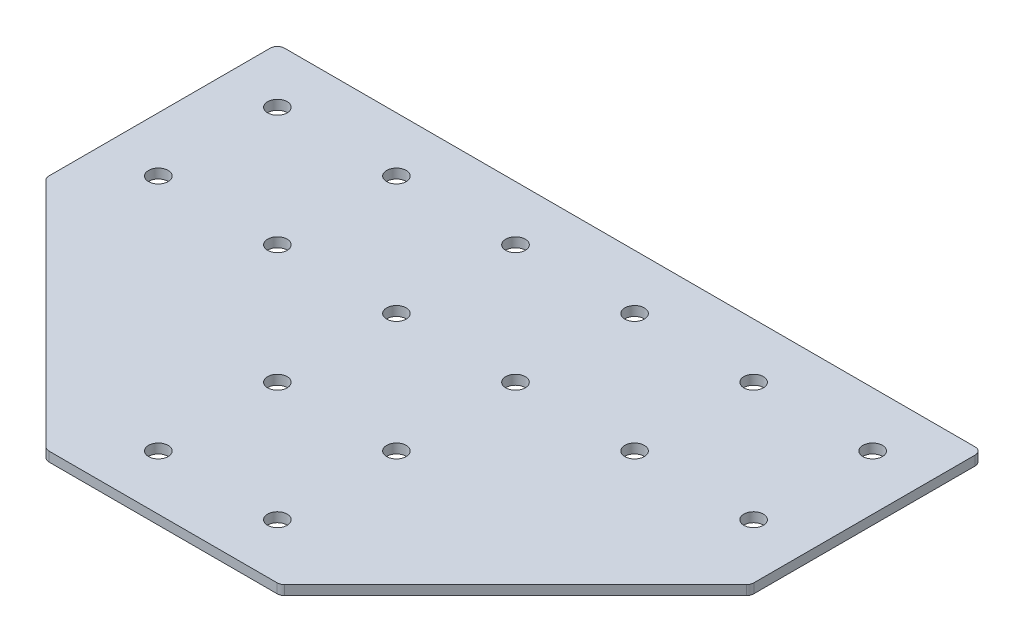
ISO-10303-21;
HEADER;
FILE_DESCRIPTION(('STEP AP214'),'2;1');
FILE_NAME('part.step','',(''),(''),'','','');
FILE_SCHEMA(('AUTOMOTIVE_DESIGN { 1 0 10303 214 1 1 1 1 }'));
ENDSEC;
DATA;
#1=APPLICATION_CONTEXT('core data for automotive mechanical design processes');
#2=APPLICATION_PROTOCOL_DEFINITION('international standard','automotive_design',2000,#1);
#3=PRODUCT_CONTEXT('',#1,'mechanical');
#4=PRODUCT('Part','Part','',(#3));
#5=PRODUCT_RELATED_PRODUCT_CATEGORY('part','',(#4));
#6=PRODUCT_DEFINITION_FORMATION('','',#4);
#7=PRODUCT_DEFINITION_CONTEXT('part definition',#1,'design');
#8=PRODUCT_DEFINITION('design','',#6,#7);
#9=PRODUCT_DEFINITION_SHAPE('','',#8);
#10=(LENGTH_UNIT() NAMED_UNIT(*) SI_UNIT(.MILLI.,.METRE.));
#11=(NAMED_UNIT(*) PLANE_ANGLE_UNIT() SI_UNIT($,.RADIAN.));
#12=(NAMED_UNIT(*) SI_UNIT($,.STERADIAN.) SOLID_ANGLE_UNIT());
#13=UNCERTAINTY_MEASURE_WITH_UNIT(LENGTH_MEASURE(1.E-05),#10,'distance_accuracy_value','');
#14=(GEOMETRIC_REPRESENTATION_CONTEXT(3) GLOBAL_UNCERTAINTY_ASSIGNED_CONTEXT((#13)) GLOBAL_UNIT_ASSIGNED_CONTEXT((#10,
#11,#12)) REPRESENTATION_CONTEXT('',''));
#15=CARTESIAN_POINT('',(0.,0.,0.));
#16=DIRECTION('',(0.,0.,1.));
#17=DIRECTION('',(1.,0.,0.));
#18=AXIS2_PLACEMENT_3D('',#15,#16,#17);
#19=CARTESIAN_POINT('',(-1.04930424271288,0.274709326684388,-51.2250354101297));
#20=DIRECTION('',(0.,-1.,0.));
#21=DIRECTION('',(0.,0.,-1.));
#22=AXIS2_PLACEMENT_3D('',#19,#20,#21);
#23=PLANE('',#22);
#24=DIRECTION('',(1.,0.,0.));
#25=VECTOR('',#24,1.);
#26=CARTESIAN_POINT('',(-49.049304242713,0.274709326684388,96.7749645898703));
#27=LINE('',#26,#25);
#28=CARTESIAN_POINT('',(-48.9782364308475,0.274709326684388,96.7749645898703));
#29=VERTEX_POINT('',#28);
#30=CARTESIAN_POINT('',(46.8796279454218,0.274709326684388,96.7749645898703));
#31=VERTEX_POINT('',#30);
#32=EDGE_CURVE('E218',#29,#31,#27,.T.);
#33=ORIENTED_EDGE('',*,*,#32,.F.);
#34=CARTESIAN_POINT('',(-48.9782364308475,0.274709326684388,93.7749645898703));
#35=DIRECTION('',(0.,1.,0.));
#36=DIRECTION('',(0.,0.,-1.));
#37=AXIS2_PLACEMENT_3D('',#34,#35,#36);
#38=CIRCLE('',#37,3.);
#39=CARTESIAN_POINT('',(-51.0995567744072,0.274709326684388,95.8962849334299));
#40=VERTEX_POINT('',#39);
#41=EDGE_CURVE('E154',#40,#29,#38,.T.);
#42=ORIENTED_EDGE('',*,*,#41,.F.);
#43=DIRECTION('',(-0.707106781186547,0.,-0.707106781186548));
#44=VECTOR('',#43,1.);
#45=CARTESIAN_POINT('',(-50.2208771179668,0.274709326684388,96.7749645898703));
#46=LINE('',#45,#44);
#47=CARTESIAN_POINT('',(-148.170624586272,0.274709326684388,-1.17478287843539));
#48=VERTEX_POINT('',#47);
#49=EDGE_CURVE('E141',#40,#48,#46,.T.);
#50=ORIENTED_EDGE('',*,*,#49,.T.);
#51=CARTESIAN_POINT('',(-146.049304242713,0.274709326684388,-3.29610322199503));
#52=DIRECTION('',(0.,1.,0.));
#53=DIRECTION('',(0.,0.,-1.));
#54=AXIS2_PLACEMENT_3D('',#51,#52,#53);
#55=CIRCLE('',#54,3.);
#56=CARTESIAN_POINT('',(-149.049304242713,0.274709326684388,-3.29610322199502));
#57=VERTEX_POINT('',#56);
#58=EDGE_CURVE('E152',#57,#48,#55,.T.);
#59=ORIENTED_EDGE('',*,*,#58,.F.);
#60=DIRECTION('',(0.,0.,-1.));
#61=VECTOR('',#60,1.);
#62=CARTESIAN_POINT('',(-149.049304242713,0.274709326684388,-2.05346253487575));
#63=LINE('',#62,#61);
#64=CARTESIAN_POINT('',(-149.049304242713,0.274709326684388,-96.2250354101297));
#65=VERTEX_POINT('',#64);
#66=EDGE_CURVE('E124',#57,#65,#63,.T.);
#67=ORIENTED_EDGE('',*,*,#66,.T.);
#68=CARTESIAN_POINT('',(-146.049304242713,0.274709326684388,-96.2250354101297));
#69=DIRECTION('',(0.,1.,0.));
#70=DIRECTION('',(0.,0.,-1.));
#71=AXIS2_PLACEMENT_3D('',#68,#69,#70);
#72=CIRCLE('',#71,3.);
#73=CARTESIAN_POINT('',(-146.049304242713,0.274709326684388,-99.2250354101297));
#74=VERTEX_POINT('',#73);
#75=EDGE_CURVE('E149',#74,#65,#72,.T.);
#76=ORIENTED_EDGE('',*,*,#75,.F.);
#77=DIRECTION('',(-1.,0.,0.));
#78=VECTOR('',#77,1.);
#79=CARTESIAN_POINT('',(146.950695757287,0.274709326684388,-99.2250354101297));
#80=LINE('',#79,#78);
#81=CARTESIAN_POINT('',(143.950695757287,0.274709326684388,-99.2250354101297));
#82=VERTEX_POINT('',#81);
#83=EDGE_CURVE('E215',#82,#74,#80,.T.);
#84=ORIENTED_EDGE('',*,*,#83,.F.);
#85=CARTESIAN_POINT('',(143.950695757287,0.274709326684388,-96.2250354101297));
#86=DIRECTION('',(0.,-1.,0.));
#87=DIRECTION('',(0.,0.,-1.));
#88=AXIS2_PLACEMENT_3D('',#85,#86,#87);
#89=CIRCLE('',#88,3.);
#90=CARTESIAN_POINT('',(146.950695757287,0.274709326684388,-96.2250354101297));
#91=VERTEX_POINT('',#90);
#92=EDGE_CURVE('E239',#82,#91,#89,.T.);
#93=ORIENTED_EDGE('',*,*,#92,.T.);
#94=DIRECTION('',(0.,0.,-1.));
#95=VECTOR('',#94,1.);
#96=CARTESIAN_POINT('',(146.950695757287,0.274709326684388,-2.05346253487579));
#97=LINE('',#96,#95);
#98=CARTESIAN_POINT('',(146.950695757287,0.274709326684388,-3.29610322199506));
#99=VERTEX_POINT('',#98);
#100=EDGE_CURVE('E212',#99,#91,#97,.T.);
#101=ORIENTED_EDGE('',*,*,#100,.F.);
#102=CARTESIAN_POINT('',(143.950695757287,0.274709326684388,-3.29610322199506));
#103=DIRECTION('',(0.,-1.,0.));
#104=DIRECTION('',(0.,0.,-1.));
#105=AXIS2_PLACEMENT_3D('',#102,#103,#104);
#106=CIRCLE('',#105,3.);
#107=CARTESIAN_POINT('',(146.072016100847,0.274709326684388,-1.17478287843542));
#108=VERTEX_POINT('',#107);
#109=EDGE_CURVE('E31',#99,#108,#106,.T.);
#110=ORIENTED_EDGE('',*,*,#109,.T.);
#111=DIRECTION('',(0.707106781186547,0.,-0.707106781186548));
#112=VECTOR('',#111,1.);
#113=CARTESIAN_POINT('',(48.1222686325411,0.274709326684388,96.7749645898703));
#114=LINE('',#113,#112);
#115=CARTESIAN_POINT('',(49.0009482889814,0.274709326684388,95.8962849334299));
#116=VERTEX_POINT('',#115);
#117=EDGE_CURVE('E220',#116,#108,#114,.T.);
#118=ORIENTED_EDGE('',*,*,#117,.F.);
#119=CARTESIAN_POINT('',(46.8796279454218,0.274709326684388,93.7749645898703));
#120=DIRECTION('',(0.,-1.,0.));
#121=DIRECTION('',(0.,0.,-1.));
#122=AXIS2_PLACEMENT_3D('',#119,#120,#121);
#123=CIRCLE('',#122,3.);
#124=EDGE_CURVE('E242',#116,#31,#123,.T.);
#125=ORIENTED_EDGE('',*,*,#124,.T.);
#126=EDGE_LOOP('',(#33,#42,#50,#59,#67,#76,#84,#93,#101,#110,#118,#125));
#127=FACE_BOUND('',#126,.T.);
#128=CARTESIAN_POINT('',(123.950695757287,0.274709326684388,-26.2250354101297));
#129=DIRECTION('',(0.,1.,0.));
#130=DIRECTION('',(0.,0.,1.));
#131=AXIS2_PLACEMENT_3D('',#128,#129,#130);
#132=CIRCLE('',#131,4.1);
#133=CARTESIAN_POINT('',(123.950695757287,0.274709326684388,-22.1250354101297));
#134=VERTEX_POINT('',#133);
#135=EDGE_CURVE('E164',#134,#134,#132,.T.);
#136=ORIENTED_EDGE('',*,*,#135,.T.);
#137=EDGE_LOOP('',(#136));
#138=FACE_BOUND('',#137,.T.);
#139=CARTESIAN_POINT('',(73.9506957572871,0.274709326684388,-26.2250354101297));
#140=DIRECTION('',(0.,1.,0.));
#141=DIRECTION('',(0.,0.,1.));
#142=AXIS2_PLACEMENT_3D('',#139,#140,#141);
#143=CIRCLE('',#142,4.09999999999999);
#144=CARTESIAN_POINT('',(73.9506957572871,0.274709326684388,-22.1250354101297));
#145=VERTEX_POINT('',#144);
#146=EDGE_CURVE('E170',#145,#145,#143,.T.);
#147=ORIENTED_EDGE('',*,*,#146,.T.);
#148=EDGE_LOOP('',(#147));
#149=FACE_BOUND('',#148,.T.);
#150=CARTESIAN_POINT('',(23.9506957572871,0.274709326684388,73.7749645898703));
#151=DIRECTION('',(0.,1.,0.));
#152=DIRECTION('',(0.,0.,1.));
#153=AXIS2_PLACEMENT_3D('',#150,#151,#152);
#154=CIRCLE('',#153,4.10000000000001);
#155=CARTESIAN_POINT('',(23.9506957572871,0.274709326684388,77.8749645898703));
#156=VERTEX_POINT('',#155);
#157=EDGE_CURVE('E176',#156,#156,#154,.T.);
#158=ORIENTED_EDGE('',*,*,#157,.T.);
#159=EDGE_LOOP('',(#158));
#160=FACE_BOUND('',#159,.T.);
#161=CARTESIAN_POINT('',(23.9506957572871,0.274709326684388,23.7749645898703));
#162=DIRECTION('',(0.,1.,0.));
#163=DIRECTION('',(0.,0.,1.));
#164=AXIS2_PLACEMENT_3D('',#161,#162,#163);
#165=CIRCLE('',#164,4.10000000000001);
#166=CARTESIAN_POINT('',(23.9506957572871,0.274709326684388,27.8749645898703));
#167=VERTEX_POINT('',#166);
#168=EDGE_CURVE('E182',#167,#167,#165,.T.);
#169=ORIENTED_EDGE('',*,*,#168,.T.);
#170=EDGE_LOOP('',(#169));
#171=FACE_BOUND('',#170,.T.);
#172=CARTESIAN_POINT('',(23.9506957572871,0.274709326684388,-26.2250354101297));
#173=DIRECTION('',(0.,1.,0.));
#174=DIRECTION('',(0.,0.,1.));
#175=AXIS2_PLACEMENT_3D('',#172,#173,#174);
#176=CIRCLE('',#175,4.1);
#177=CARTESIAN_POINT('',(23.9506957572871,0.274709326684388,-22.1250354101297));
#178=VERTEX_POINT('',#177);
#179=EDGE_CURVE('E188',#178,#178,#176,.T.);
#180=ORIENTED_EDGE('',*,*,#179,.T.);
#181=EDGE_LOOP('',(#180));
#182=FACE_BOUND('',#181,.T.);
#183=CARTESIAN_POINT('',(123.950695757287,0.274709326684388,-76.2250354101297));
#184=DIRECTION('',(0.,1.,0.));
#185=DIRECTION('',(0.,0.,1.));
#186=AXIS2_PLACEMENT_3D('',#183,#184,#185);
#187=CIRCLE('',#186,4.09999999999999);
#188=CARTESIAN_POINT('',(123.950695757287,0.274709326684388,-72.1250354101297));
#189=VERTEX_POINT('',#188);
#190=EDGE_CURVE('E194',#189,#189,#187,.T.);
#191=ORIENTED_EDGE('',*,*,#190,.T.);
#192=EDGE_LOOP('',(#191));
#193=FACE_BOUND('',#192,.T.);
#194=CARTESIAN_POINT('',(73.9506957572871,0.274709326684388,-76.2250354101297));
#195=DIRECTION('',(0.,1.,0.));
#196=DIRECTION('',(0.,0.,1.));
#197=AXIS2_PLACEMENT_3D('',#194,#195,#196);
#198=CIRCLE('',#197,4.09999999999999);
#199=CARTESIAN_POINT('',(73.9506957572871,0.274709326684388,-72.1250354101297));
#200=VERTEX_POINT('',#199);
#201=EDGE_CURVE('E200',#200,#200,#198,.T.);
#202=ORIENTED_EDGE('',*,*,#201,.T.);
#203=EDGE_LOOP('',(#202));
#204=FACE_BOUND('',#203,.T.);
#205=CARTESIAN_POINT('',(23.9506957572871,0.274709326684388,-76.2250354101297));
#206=DIRECTION('',(0.,1.,0.));
#207=DIRECTION('',(0.,0.,1.));
#208=AXIS2_PLACEMENT_3D('',#205,#206,#207);
#209=CIRCLE('',#208,4.1);
#210=CARTESIAN_POINT('',(23.9506957572871,0.274709326684388,-72.1250354101297));
#211=VERTEX_POINT('',#210);
#212=EDGE_CURVE('E206',#211,#211,#209,.T.);
#213=ORIENTED_EDGE('',*,*,#212,.T.);
#214=EDGE_LOOP('',(#213));
#215=FACE_BOUND('',#214,.T.);
#216=CARTESIAN_POINT('',(-126.049304242713,0.274709326684388,-26.2250354101296));
#217=DIRECTION('',(0.,-1.,0.));
#218=DIRECTION('',(0.,0.,1.));
#219=AXIS2_PLACEMENT_3D('',#216,#217,#218);
#220=CIRCLE('',#219,4.1);
#221=CARTESIAN_POINT('',(-126.049304242713,0.274709326684388,-22.1250354101296));
#222=VERTEX_POINT('',#221);
#223=EDGE_CURVE('E318',#222,#222,#220,.T.);
#224=ORIENTED_EDGE('',*,*,#223,.F.);
#225=EDGE_LOOP('',(#224));
#226=FACE_BOUND('',#225,.T.);
#227=CARTESIAN_POINT('',(-76.0493042427129,0.274709326684388,-26.2250354101297));
#228=DIRECTION('',(0.,-1.,0.));
#229=DIRECTION('',(0.,0.,1.));
#230=AXIS2_PLACEMENT_3D('',#227,#228,#229);
#231=CIRCLE('',#230,4.09999999999999);
#232=CARTESIAN_POINT('',(-76.0493042427129,0.274709326684388,-22.1250354101297));
#233=VERTEX_POINT('',#232);
#234=EDGE_CURVE('E312',#233,#233,#231,.T.);
#235=ORIENTED_EDGE('',*,*,#234,.F.);
#236=EDGE_LOOP('',(#235));
#237=FACE_BOUND('',#236,.T.);
#238=CARTESIAN_POINT('',(-26.0493042427128,0.274709326684388,73.7749645898703));
#239=DIRECTION('',(0.,-1.,0.));
#240=DIRECTION('',(0.,0.,1.));
#241=AXIS2_PLACEMENT_3D('',#238,#239,#240);
#242=CIRCLE('',#241,4.10000000000001);
#243=CARTESIAN_POINT('',(-26.0493042427128,0.274709326684388,77.8749645898703));
#244=VERTEX_POINT('',#243);
#245=EDGE_CURVE('E306',#244,#244,#242,.T.);
#246=ORIENTED_EDGE('',*,*,#245,.F.);
#247=EDGE_LOOP('',(#246));
#248=FACE_BOUND('',#247,.T.);
#249=CARTESIAN_POINT('',(-26.0493042427129,0.274709326684388,23.7749645898703));
#250=DIRECTION('',(0.,-1.,0.));
#251=DIRECTION('',(0.,0.,1.));
#252=AXIS2_PLACEMENT_3D('',#249,#250,#251);
#253=CIRCLE('',#252,4.10000000000001);
#254=CARTESIAN_POINT('',(-26.0493042427129,0.274709326684388,27.8749645898703));
#255=VERTEX_POINT('',#254);
#256=EDGE_CURVE('E300',#255,#255,#253,.T.);
#257=ORIENTED_EDGE('',*,*,#256,.F.);
#258=EDGE_LOOP('',(#257));
#259=FACE_BOUND('',#258,.T.);
#260=CARTESIAN_POINT('',(-26.0493042427129,0.274709326684388,-26.2250354101297));
#261=DIRECTION('',(0.,-1.,0.));
#262=DIRECTION('',(0.,0.,1.));
#263=AXIS2_PLACEMENT_3D('',#260,#261,#262);
#264=CIRCLE('',#263,4.1);
#265=CARTESIAN_POINT('',(-26.0493042427129,0.274709326684388,-22.1250354101297));
#266=VERTEX_POINT('',#265);
#267=EDGE_CURVE('E294',#266,#266,#264,.T.);
#268=ORIENTED_EDGE('',*,*,#267,.F.);
#269=EDGE_LOOP('',(#268));
#270=FACE_BOUND('',#269,.T.);
#271=CARTESIAN_POINT('',(-126.049304242713,0.274709326684388,-76.2250354101297));
#272=DIRECTION('',(0.,-1.,0.));
#273=DIRECTION('',(0.,0.,1.));
#274=AXIS2_PLACEMENT_3D('',#271,#272,#273);
#275=CIRCLE('',#274,4.09999999999999);
#276=CARTESIAN_POINT('',(-126.049304242713,0.274709326684388,-72.1250354101297));
#277=VERTEX_POINT('',#276);
#278=EDGE_CURVE('E288',#277,#277,#275,.T.);
#279=ORIENTED_EDGE('',*,*,#278,.F.);
#280=EDGE_LOOP('',(#279));
#281=FACE_BOUND('',#280,.T.);
#282=CARTESIAN_POINT('',(-76.0493042427129,0.274709326684388,-76.2250354101297));
#283=DIRECTION('',(0.,-1.,0.));
#284=DIRECTION('',(0.,0.,1.));
#285=AXIS2_PLACEMENT_3D('',#282,#283,#284);
#286=CIRCLE('',#285,4.09999999999999);
#287=CARTESIAN_POINT('',(-76.0493042427129,0.274709326684388,-72.1250354101297));
#288=VERTEX_POINT('',#287);
#289=EDGE_CURVE('E283',#288,#288,#286,.T.);
#290=ORIENTED_EDGE('',*,*,#289,.F.);
#291=EDGE_LOOP('',(#290));
#292=FACE_BOUND('',#291,.T.);
#293=CARTESIAN_POINT('',(-26.0493042427129,0.274709326684388,-76.2250354101297));
#294=DIRECTION('',(0.,-1.,0.));
#295=DIRECTION('',(0.,0.,1.));
#296=AXIS2_PLACEMENT_3D('',#293,#294,#295);
#297=CIRCLE('',#296,4.1);
#298=CARTESIAN_POINT('',(-26.0493042427129,0.274709326684388,-72.1250354101297));
#299=VERTEX_POINT('',#298);
#300=EDGE_CURVE('E134',#299,#299,#297,.T.);
#301=ORIENTED_EDGE('',*,*,#300,.F.);
#302=EDGE_LOOP('',(#301));
#303=FACE_BOUND('',#302,.T.);
#304=ADVANCED_FACE('F16',(#127,#138,#149,#160,#171,#182,#193,#204,#215,#226,#237,#248,#259,#270,
#281,#292,#303),#23,.T.);
#305=CARTESIAN_POINT('',(146.950695757287,0.274709326684388,-2.05346253487579));
#306=DIRECTION('',(1.,0.,0.));
#307=DIRECTION('',(0.,0.,-1.));
#308=AXIS2_PLACEMENT_3D('',#305,#306,#307);
#309=PLANE('',#308);
#310=DIRECTION('',(0.,0.,-1.));
#311=VECTOR('',#310,1.);
#312=CARTESIAN_POINT('',(146.950695757287,4.27470932668439,-2.05346253487579));
#313=LINE('',#312,#311);
#314=CARTESIAN_POINT('',(146.950695757287,4.27470932668439,-3.29610322199506));
#315=VERTEX_POINT('',#314);
#316=CARTESIAN_POINT('',(146.950695757287,4.27470932668439,-96.2250354101297));
#317=VERTEX_POINT('',#316);
#318=EDGE_CURVE('E209',#315,#317,#313,.T.);
#319=ORIENTED_EDGE('',*,*,#318,.F.);
#320=DIRECTION('',(0.,1.,0.));
#321=VECTOR('',#320,1.);
#322=CARTESIAN_POINT('',(146.950695757287,0.274709326684388,-3.29610322199506));
#323=LINE('',#322,#321);
#324=EDGE_CURVE('E24',#315,#99,#323,.F.);
#325=ORIENTED_EDGE('',*,*,#324,.T.);
#326=ORIENTED_EDGE('',*,*,#100,.T.);
#327=DIRECTION('',(0.,1.,0.));
#328=VECTOR('',#327,1.);
#329=CARTESIAN_POINT('',(146.950695757287,0.274709326684388,-96.2250354101297));
#330=LINE('',#329,#328);
#331=EDGE_CURVE('E249',#91,#317,#330,.T.);
#332=ORIENTED_EDGE('',*,*,#331,.T.);
#333=EDGE_LOOP('',(#319,#325,#326,#332));
#334=FACE_BOUND('',#333,.T.);
#335=ADVANCED_FACE('F254',(#334),#309,.T.);
#336=CARTESIAN_POINT('',(48.1222686325411,0.274709326684388,96.7749645898703));
#337=DIRECTION('',(0.707106781186548,0.,0.707106781186547));
#338=DIRECTION('',(0.707106781186547,0.,-0.707106781186548));
#339=AXIS2_PLACEMENT_3D('',#336,#337,#338);
#340=PLANE('',#339);
#341=DIRECTION('',(0.707106781186547,0.,-0.707106781186548));
#342=VECTOR('',#341,1.);
#343=CARTESIAN_POINT('',(48.1222686325411,4.27470932668439,96.7749645898703));
#344=LINE('',#343,#342);
#345=CARTESIAN_POINT('',(49.0009482889814,4.27470932668439,95.8962849334299));
#346=VERTEX_POINT('',#345);
#347=CARTESIAN_POINT('',(146.072016100847,4.27470932668439,-1.17478287843542));
#348=VERTEX_POINT('',#347);
#349=EDGE_CURVE('E216',#346,#348,#344,.T.);
#350=ORIENTED_EDGE('',*,*,#349,.F.);
#351=DIRECTION('',(0.,1.,0.));
#352=VECTOR('',#351,1.);
#353=CARTESIAN_POINT('',(49.0009482889814,0.274709326684388,95.8962849334299));
#354=LINE('',#353,#352);
#355=EDGE_CURVE('E38',#346,#116,#354,.F.);
#356=ORIENTED_EDGE('',*,*,#355,.T.);
#357=ORIENTED_EDGE('',*,*,#117,.T.);
#358=DIRECTION('',(0.,1.,0.));
#359=VECTOR('',#358,1.);
#360=CARTESIAN_POINT('',(146.072016100847,0.274709326684388,-1.17478287843541));
#361=LINE('',#360,#359);
#362=EDGE_CURVE('E245',#108,#348,#361,.T.);
#363=ORIENTED_EDGE('',*,*,#362,.T.);
#364=EDGE_LOOP('',(#350,#356,#357,#363));
#365=FACE_BOUND('',#364,.T.);
#366=ADVANCED_FACE('F262',(#365),#340,.T.);
#367=CARTESIAN_POINT('',(-49.049304242713,0.274709326684388,96.7749645898703));
#368=DIRECTION('',(0.,0.,1.));
#369=DIRECTION('',(1.,0.,0.));
#370=AXIS2_PLACEMENT_3D('',#367,#368,#369);
#371=PLANE('',#370);
#372=DIRECTION('',(1.,0.,0.));
#373=VECTOR('',#372,1.);
#374=CARTESIAN_POINT('',(-49.049304242713,4.27470932668439,96.7749645898703));
#375=LINE('',#374,#373);
#376=CARTESIAN_POINT('',(-48.9782364308475,4.27470932668439,96.7749645898703));
#377=VERTEX_POINT('',#376);
#378=CARTESIAN_POINT('',(46.8796279454218,4.27470932668439,96.7749645898703));
#379=VERTEX_POINT('',#378);
#380=EDGE_CURVE('E227',#377,#379,#375,.T.);
#381=ORIENTED_EDGE('',*,*,#380,.F.);
#382=DIRECTION('',(0.,1.,0.));
#383=VECTOR('',#382,1.);
#384=CARTESIAN_POINT('',(-48.9782364308475,0.274709326684388,96.7749645898703));
#385=LINE('',#384,#383);
#386=EDGE_CURVE('E146',#29,#377,#385,.T.);
#387=ORIENTED_EDGE('',*,*,#386,.F.);
#388=ORIENTED_EDGE('',*,*,#32,.T.);
#389=DIRECTION('',(0.,1.,0.));
#390=VECTOR('',#389,1.);
#391=CARTESIAN_POINT('',(46.8796279454218,0.274709326684388,96.7749645898703));
#392=LINE('',#391,#390);
#393=EDGE_CURVE('E236',#31,#379,#392,.T.);
#394=ORIENTED_EDGE('',*,*,#393,.T.);
#395=EDGE_LOOP('',(#381,#387,#388,#394));
#396=FACE_BOUND('',#395,.T.);
#397=ADVANCED_FACE('F270',(#396),#371,.T.);
#398=CARTESIAN_POINT('',(146.950695757287,0.274709326684388,-99.2250354101297));
#399=DIRECTION('',(0.,0.,-1.));
#400=DIRECTION('',(-1.,0.,0.));
#401=AXIS2_PLACEMENT_3D('',#398,#399,#400);
#402=PLANE('',#401);
#403=ORIENTED_EDGE('',*,*,#83,.T.);
#404=DIRECTION('',(0.,1.,0.));
#405=VECTOR('',#404,1.);
#406=CARTESIAN_POINT('',(-146.049304242713,0.274709326684388,-99.2250354101297));
#407=LINE('',#406,#405);
#408=CARTESIAN_POINT('',(-146.049304242713,4.27470932668439,-99.2250354101297));
#409=VERTEX_POINT('',#408);
#410=EDGE_CURVE('E126',#409,#74,#407,.F.);
#411=ORIENTED_EDGE('',*,*,#410,.F.);
#412=DIRECTION('',(-1.,0.,0.));
#413=VECTOR('',#412,1.);
#414=CARTESIAN_POINT('',(146.950695757287,4.27470932668439,-99.2250354101297));
#415=LINE('',#414,#413);
#416=CARTESIAN_POINT('',(143.950695757287,4.27470932668439,-99.2250354101297));
#417=VERTEX_POINT('',#416);
#418=EDGE_CURVE('E225',#417,#409,#415,.T.);
#419=ORIENTED_EDGE('',*,*,#418,.F.);
#420=DIRECTION('',(0.,1.,0.));
#421=VECTOR('',#420,1.);
#422=CARTESIAN_POINT('',(143.950695757287,0.274709326684388,-99.2250354101297));
#423=LINE('',#422,#421);
#424=EDGE_CURVE('E10',#417,#82,#423,.F.);
#425=ORIENTED_EDGE('',*,*,#424,.T.);
#426=EDGE_LOOP('',(#403,#411,#419,#425));
#427=FACE_BOUND('',#426,.T.);
#428=ADVANCED_FACE('F356',(#427),#402,.T.);
#429=CARTESIAN_POINT('',(-1.04930424271288,4.27470932668439,-51.2250354101297));
#430=DIRECTION('',(0.,-1.,0.));
#431=DIRECTION('',(0.,0.,-1.));
#432=AXIS2_PLACEMENT_3D('',#429,#430,#431);
#433=PLANE('',#432);
#434=CARTESIAN_POINT('',(123.950695757287,4.27470932668439,-26.2250354101297));
#435=DIRECTION('',(0.,1.,0.));
#436=DIRECTION('',(0.,0.,1.));
#437=AXIS2_PLACEMENT_3D('',#434,#435,#436);
#438=CIRCLE('',#437,4.1);
#439=CARTESIAN_POINT('',(123.950695757287,4.27470932668439,-22.1250354101297));
#440=VERTEX_POINT('',#439);
#441=EDGE_CURVE('E163',#440,#440,#438,.T.);
#442=ORIENTED_EDGE('',*,*,#441,.F.);
#443=EDGE_LOOP('',(#442));
#444=FACE_BOUND('',#443,.T.);
#445=CARTESIAN_POINT('',(73.9506957572871,4.27470932668439,-26.2250354101297));
#446=DIRECTION('',(0.,1.,0.));
#447=DIRECTION('',(0.,0.,1.));
#448=AXIS2_PLACEMENT_3D('',#445,#446,#447);
#449=CIRCLE('',#448,4.09999999999999);
#450=CARTESIAN_POINT('',(73.9506957572871,4.27470932668439,-22.1250354101297));
#451=VERTEX_POINT('',#450);
#452=EDGE_CURVE('E167',#451,#451,#449,.T.);
#453=ORIENTED_EDGE('',*,*,#452,.F.);
#454=EDGE_LOOP('',(#453));
#455=FACE_BOUND('',#454,.T.);
#456=CARTESIAN_POINT('',(23.9506957572871,4.27470932668439,73.7749645898703));
#457=DIRECTION('',(0.,1.,0.));
#458=DIRECTION('',(0.,0.,1.));
#459=AXIS2_PLACEMENT_3D('',#456,#457,#458);
#460=CIRCLE('',#459,4.10000000000001);
#461=CARTESIAN_POINT('',(23.9506957572871,4.27470932668439,77.8749645898703));
#462=VERTEX_POINT('',#461);
#463=EDGE_CURVE('E173',#462,#462,#460,.T.);
#464=ORIENTED_EDGE('',*,*,#463,.F.);
#465=EDGE_LOOP('',(#464));
#466=FACE_BOUND('',#465,.T.);
#467=CARTESIAN_POINT('',(23.9506957572871,4.27470932668439,23.7749645898703));
#468=DIRECTION('',(0.,1.,0.));
#469=DIRECTION('',(0.,0.,1.));
#470=AXIS2_PLACEMENT_3D('',#467,#468,#469);
#471=CIRCLE('',#470,4.10000000000001);
#472=CARTESIAN_POINT('',(23.9506957572871,4.27470932668439,27.8749645898703));
#473=VERTEX_POINT('',#472);
#474=EDGE_CURVE('E179',#473,#473,#471,.T.);
#475=ORIENTED_EDGE('',*,*,#474,.F.);
#476=EDGE_LOOP('',(#475));
#477=FACE_BOUND('',#476,.T.);
#478=CARTESIAN_POINT('',(23.9506957572871,4.27470932668439,-26.2250354101297));
#479=DIRECTION('',(0.,1.,0.));
#480=DIRECTION('',(0.,0.,1.));
#481=AXIS2_PLACEMENT_3D('',#478,#479,#480);
#482=CIRCLE('',#481,4.1);
#483=CARTESIAN_POINT('',(23.9506957572871,4.27470932668439,-22.1250354101297));
#484=VERTEX_POINT('',#483);
#485=EDGE_CURVE('E185',#484,#484,#482,.T.);
#486=ORIENTED_EDGE('',*,*,#485,.F.);
#487=EDGE_LOOP('',(#486));
#488=FACE_BOUND('',#487,.T.);
#489=CARTESIAN_POINT('',(123.950695757287,4.27470932668439,-76.2250354101297));
#490=DIRECTION('',(0.,1.,0.));
#491=DIRECTION('',(0.,0.,1.));
#492=AXIS2_PLACEMENT_3D('',#489,#490,#491);
#493=CIRCLE('',#492,4.09999999999999);
#494=CARTESIAN_POINT('',(123.950695757287,4.27470932668439,-72.1250354101297));
#495=VERTEX_POINT('',#494);
#496=EDGE_CURVE('E191',#495,#495,#493,.T.);
#497=ORIENTED_EDGE('',*,*,#496,.F.);
#498=EDGE_LOOP('',(#497));
#499=FACE_BOUND('',#498,.T.);
#500=CARTESIAN_POINT('',(73.9506957572871,4.27470932668439,-76.2250354101297));
#501=DIRECTION('',(0.,1.,0.));
#502=DIRECTION('',(0.,0.,1.));
#503=AXIS2_PLACEMENT_3D('',#500,#501,#502);
#504=CIRCLE('',#503,4.09999999999999);
#505=CARTESIAN_POINT('',(73.9506957572871,4.27470932668439,-72.1250354101297));
#506=VERTEX_POINT('',#505);
#507=EDGE_CURVE('E197',#506,#506,#504,.T.);
#508=ORIENTED_EDGE('',*,*,#507,.F.);
#509=EDGE_LOOP('',(#508));
#510=FACE_BOUND('',#509,.T.);
#511=CARTESIAN_POINT('',(23.9506957572871,4.27470932668439,-76.2250354101297));
#512=DIRECTION('',(0.,1.,0.));
#513=DIRECTION('',(0.,0.,1.));
#514=AXIS2_PLACEMENT_3D('',#511,#512,#513);
#515=CIRCLE('',#514,4.1);
#516=CARTESIAN_POINT('',(23.9506957572871,4.27470932668439,-72.1250354101297));
#517=VERTEX_POINT('',#516);
#518=EDGE_CURVE('E203',#517,#517,#515,.T.);
#519=ORIENTED_EDGE('',*,*,#518,.F.);
#520=EDGE_LOOP('',(#519));
#521=FACE_BOUND('',#520,.T.);
#522=ORIENTED_EDGE('',*,*,#418,.T.);
#523=CARTESIAN_POINT('',(-146.049304242713,4.27470932668439,-96.2250354101297));
#524=DIRECTION('',(0.,1.,0.));
#525=DIRECTION('',(0.,0.,-1.));
#526=AXIS2_PLACEMENT_3D('',#523,#524,#525);
#527=CIRCLE('',#526,3.);
#528=CARTESIAN_POINT('',(-149.049304242713,4.27470932668439,-96.2250354101297));
#529=VERTEX_POINT('',#528);
#530=EDGE_CURVE('E117',#529,#409,#527,.F.);
#531=ORIENTED_EDGE('',*,*,#530,.F.);
#532=DIRECTION('',(0.,0.,-1.));
#533=VECTOR('',#532,1.);
#534=CARTESIAN_POINT('',(-149.049304242713,4.27470932668439,-2.05346253487575));
#535=LINE('',#534,#533);
#536=CARTESIAN_POINT('',(-149.049304242713,4.27470932668439,-3.29610322199502));
#537=VERTEX_POINT('',#536);
#538=EDGE_CURVE('E122',#537,#529,#535,.T.);
#539=ORIENTED_EDGE('',*,*,#538,.F.);
#540=CARTESIAN_POINT('',(-146.049304242713,4.27470932668439,-3.29610322199503));
#541=DIRECTION('',(0.,1.,0.));
#542=DIRECTION('',(0.,0.,-1.));
#543=AXIS2_PLACEMENT_3D('',#540,#541,#542);
#544=CIRCLE('',#543,3.);
#545=CARTESIAN_POINT('',(-148.170624586272,4.27470932668439,-1.17478287843539));
#546=VERTEX_POINT('',#545);
#547=EDGE_CURVE('E105',#546,#537,#544,.F.);
#548=ORIENTED_EDGE('',*,*,#547,.F.);
#549=DIRECTION('',(-0.707106781186547,0.,-0.707106781186548));
#550=VECTOR('',#549,1.);
#551=CARTESIAN_POINT('',(-50.2208771179668,4.27470932668439,96.7749645898703));
#552=LINE('',#551,#550);
#553=CARTESIAN_POINT('',(-51.0995567744072,4.27470932668439,95.8962849334299));
#554=VERTEX_POINT('',#553);
#555=EDGE_CURVE('E133',#554,#546,#552,.T.);
#556=ORIENTED_EDGE('',*,*,#555,.F.);
#557=CARTESIAN_POINT('',(-48.9782364308475,4.27470932668439,93.7749645898703));
#558=DIRECTION('',(0.,1.,0.));
#559=DIRECTION('',(0.,0.,-1.));
#560=AXIS2_PLACEMENT_3D('',#557,#558,#559);
#561=CIRCLE('',#560,3.);
#562=EDGE_CURVE('E116',#377,#554,#561,.F.);
#563=ORIENTED_EDGE('',*,*,#562,.F.);
#564=ORIENTED_EDGE('',*,*,#380,.T.);
#565=CARTESIAN_POINT('',(46.8796279454218,4.27470932668439,93.7749645898703));
#566=DIRECTION('',(0.,-1.,0.));
#567=DIRECTION('',(0.,0.,-1.));
#568=AXIS2_PLACEMENT_3D('',#565,#566,#567);
#569=CIRCLE('',#568,3.);
#570=EDGE_CURVE('E234',#379,#346,#569,.F.);
#571=ORIENTED_EDGE('',*,*,#570,.T.);
#572=ORIENTED_EDGE('',*,*,#349,.T.);
#573=CARTESIAN_POINT('',(143.950695757287,4.27470932668439,-3.29610322199506));
#574=DIRECTION('',(0.,-1.,0.));
#575=DIRECTION('',(0.,0.,-1.));
#576=AXIS2_PLACEMENT_3D('',#573,#574,#575);
#577=CIRCLE('',#576,3.);
#578=EDGE_CURVE('E232',#348,#315,#577,.F.);
#579=ORIENTED_EDGE('',*,*,#578,.T.);
#580=ORIENTED_EDGE('',*,*,#318,.T.);
#581=CARTESIAN_POINT('',(143.950695757287,4.27470932668439,-96.2250354101297));
#582=DIRECTION('',(0.,-1.,0.));
#583=DIRECTION('',(0.,0.,-1.));
#584=AXIS2_PLACEMENT_3D('',#581,#582,#583);
#585=CIRCLE('',#584,3.);
#586=EDGE_CURVE('E222',#317,#417,#585,.F.);
#587=ORIENTED_EDGE('',*,*,#586,.T.);
#588=EDGE_LOOP('',(#522,#531,#539,#548,#556,#563,#564,#571,#572,#579,#580,#587));
#589=FACE_BOUND('',#588,.T.);
#590=CARTESIAN_POINT('',(-126.049304242713,4.27470932668439,-26.2250354101296));
#591=DIRECTION('',(0.,-1.,0.));
#592=DIRECTION('',(0.,0.,1.));
#593=AXIS2_PLACEMENT_3D('',#590,#591,#592);
#594=CIRCLE('',#593,4.1);
#595=CARTESIAN_POINT('',(-126.049304242713,4.27470932668439,-22.1250354101296));
#596=VERTEX_POINT('',#595);
#597=EDGE_CURVE('E321',#596,#596,#594,.T.);
#598=ORIENTED_EDGE('',*,*,#597,.T.);
#599=EDGE_LOOP('',(#598));
#600=FACE_BOUND('',#599,.T.);
#601=CARTESIAN_POINT('',(-76.0493042427129,4.27470932668439,-26.2250354101297));
#602=DIRECTION('',(0.,-1.,0.));
#603=DIRECTION('',(0.,0.,1.));
#604=AXIS2_PLACEMENT_3D('',#601,#602,#603);
#605=CIRCLE('',#604,4.09999999999999);
#606=CARTESIAN_POINT('',(-76.0493042427129,4.27470932668439,-22.1250354101297));
#607=VERTEX_POINT('',#606);
#608=EDGE_CURVE('E315',#607,#607,#605,.T.);
#609=ORIENTED_EDGE('',*,*,#608,.T.);
#610=EDGE_LOOP('',(#609));
#611=FACE_BOUND('',#610,.T.);
#612=CARTESIAN_POINT('',(-26.0493042427128,4.27470932668439,73.7749645898703));
#613=DIRECTION('',(0.,-1.,0.));
#614=DIRECTION('',(0.,0.,1.));
#615=AXIS2_PLACEMENT_3D('',#612,#613,#614);
#616=CIRCLE('',#615,4.10000000000001);
#617=CARTESIAN_POINT('',(-26.0493042427128,4.27470932668439,77.8749645898703));
#618=VERTEX_POINT('',#617);
#619=EDGE_CURVE('E309',#618,#618,#616,.T.);
#620=ORIENTED_EDGE('',*,*,#619,.T.);
#621=EDGE_LOOP('',(#620));
#622=FACE_BOUND('',#621,.T.);
#623=CARTESIAN_POINT('',(-26.0493042427129,4.27470932668439,23.7749645898703));
#624=DIRECTION('',(0.,-1.,0.));
#625=DIRECTION('',(0.,0.,1.));
#626=AXIS2_PLACEMENT_3D('',#623,#624,#625);
#627=CIRCLE('',#626,4.10000000000001);
#628=CARTESIAN_POINT('',(-26.0493042427129,4.27470932668439,27.8749645898703));
#629=VERTEX_POINT('',#628);
#630=EDGE_CURVE('E303',#629,#629,#627,.T.);
#631=ORIENTED_EDGE('',*,*,#630,.T.);
#632=EDGE_LOOP('',(#631));
#633=FACE_BOUND('',#632,.T.);
#634=CARTESIAN_POINT('',(-26.0493042427129,4.27470932668439,-26.2250354101297));
#635=DIRECTION('',(0.,-1.,0.));
#636=DIRECTION('',(0.,0.,1.));
#637=AXIS2_PLACEMENT_3D('',#634,#635,#636);
#638=CIRCLE('',#637,4.1);
#639=CARTESIAN_POINT('',(-26.0493042427129,4.27470932668439,-22.1250354101297));
#640=VERTEX_POINT('',#639);
#641=EDGE_CURVE('E297',#640,#640,#638,.T.);
#642=ORIENTED_EDGE('',*,*,#641,.T.);
#643=EDGE_LOOP('',(#642));
#644=FACE_BOUND('',#643,.T.);
#645=CARTESIAN_POINT('',(-126.049304242713,4.27470932668439,-76.2250354101297));
#646=DIRECTION('',(0.,-1.,0.));
#647=DIRECTION('',(0.,0.,1.));
#648=AXIS2_PLACEMENT_3D('',#645,#646,#647);
#649=CIRCLE('',#648,4.09999999999999);
#650=CARTESIAN_POINT('',(-126.049304242713,4.27470932668439,-72.1250354101297));
#651=VERTEX_POINT('',#650);
#652=EDGE_CURVE('E291',#651,#651,#649,.T.);
#653=ORIENTED_EDGE('',*,*,#652,.T.);
#654=EDGE_LOOP('',(#653));
#655=FACE_BOUND('',#654,.T.);
#656=CARTESIAN_POINT('',(-76.0493042427129,4.27470932668439,-76.2250354101297));
#657=DIRECTION('',(0.,-1.,0.));
#658=DIRECTION('',(0.,0.,1.));
#659=AXIS2_PLACEMENT_3D('',#656,#657,#658);
#660=CIRCLE('',#659,4.09999999999999);
#661=CARTESIAN_POINT('',(-76.0493042427129,4.27470932668439,-72.1250354101297));
#662=VERTEX_POINT('',#661);
#663=EDGE_CURVE('E285',#662,#662,#660,.T.);
#664=ORIENTED_EDGE('',*,*,#663,.T.);
#665=EDGE_LOOP('',(#664));
#666=FACE_BOUND('',#665,.T.);
#667=CARTESIAN_POINT('',(-26.0493042427129,4.27470932668439,-76.2250354101297));
#668=DIRECTION('',(0.,-1.,0.));
#669=DIRECTION('',(0.,0.,1.));
#670=AXIS2_PLACEMENT_3D('',#667,#668,#669);
#671=CIRCLE('',#670,4.1);
#672=CARTESIAN_POINT('',(-26.0493042427129,4.27470932668439,-72.1250354101297));
#673=VERTEX_POINT('',#672);
#674=EDGE_CURVE('E138',#673,#673,#671,.T.);
#675=ORIENTED_EDGE('',*,*,#674,.T.);
#676=EDGE_LOOP('',(#675));
#677=FACE_BOUND('',#676,.T.);
#678=ADVANCED_FACE('F129',(#444,#455,#466,#477,#488,#499,#510,#521,#589,#600,#611,#622,#633,
#644,#655,#666,#677),#433,.F.);
#679=CARTESIAN_POINT('',(46.8796279454218,0.274709326684388,93.7749645898703));
#680=DIRECTION('',(0.,1.,0.));
#681=DIRECTION('',(0.,0.,1.));
#682=AXIS2_PLACEMENT_3D('',#679,#680,#681);
#683=CYLINDRICAL_SURFACE('',#682,3.);
#684=ORIENTED_EDGE('',*,*,#124,.F.);
#685=ORIENTED_EDGE('',*,*,#355,.F.);
#686=ORIENTED_EDGE('',*,*,#570,.F.);
#687=ORIENTED_EDGE('',*,*,#393,.F.);
#688=EDGE_LOOP('',(#684,#685,#686,#687));
#689=FACE_BOUND('',#688,.T.);
#690=ADVANCED_FACE('F268',(#689),#683,.T.);
#691=CARTESIAN_POINT('',(143.950695757287,0.274709326684388,-3.29610322199506));
#692=DIRECTION('',(0.,1.,0.));
#693=DIRECTION('',(0.,0.,1.));
#694=AXIS2_PLACEMENT_3D('',#691,#692,#693);
#695=CYLINDRICAL_SURFACE('',#694,3.);
#696=ORIENTED_EDGE('',*,*,#109,.F.);
#697=ORIENTED_EDGE('',*,*,#324,.F.);
#698=ORIENTED_EDGE('',*,*,#578,.F.);
#699=ORIENTED_EDGE('',*,*,#362,.F.);
#700=EDGE_LOOP('',(#696,#697,#698,#699));
#701=FACE_BOUND('',#700,.T.);
#702=ADVANCED_FACE('F261',(#701),#695,.T.);
#703=CARTESIAN_POINT('',(143.950695757287,0.274709326684388,-96.2250354101297));
#704=DIRECTION('',(0.,1.,0.));
#705=DIRECTION('',(0.,0.,1.));
#706=AXIS2_PLACEMENT_3D('',#703,#704,#705);
#707=CYLINDRICAL_SURFACE('',#706,3.);
#708=ORIENTED_EDGE('',*,*,#92,.F.);
#709=ORIENTED_EDGE('',*,*,#424,.F.);
#710=ORIENTED_EDGE('',*,*,#586,.F.);
#711=ORIENTED_EDGE('',*,*,#331,.F.);
#712=EDGE_LOOP('',(#708,#709,#710,#711));
#713=FACE_BOUND('',#712,.T.);
#714=ADVANCED_FACE('F18',(#713),#707,.T.);
#715=CARTESIAN_POINT('',(23.9506957572871,0.274709326684388,-76.2250354101297));
#716=DIRECTION('',(0.,1.,0.));
#717=DIRECTION('',(0.,0.,1.));
#718=AXIS2_PLACEMENT_3D('',#715,#716,#717);
#719=CYLINDRICAL_SURFACE('',#718,4.1);
#720=ORIENTED_EDGE('',*,*,#212,.F.);
#721=EDGE_LOOP('',(#720));
#722=FACE_BOUND('',#721,.T.);
#723=ORIENTED_EDGE('',*,*,#518,.T.);
#724=EDGE_LOOP('',(#723));
#725=FACE_BOUND('',#724,.T.);
#726=ADVANCED_FACE('F374',(#722,#725),#719,.F.);
#727=CARTESIAN_POINT('',(73.9506957572871,0.274709326684388,-76.2250354101297));
#728=DIRECTION('',(0.,1.,0.));
#729=DIRECTION('',(0.,0.,1.));
#730=AXIS2_PLACEMENT_3D('',#727,#728,#729);
#731=CYLINDRICAL_SURFACE('',#730,4.09999999999999);
#732=ORIENTED_EDGE('',*,*,#201,.F.);
#733=EDGE_LOOP('',(#732));
#734=FACE_BOUND('',#733,.T.);
#735=ORIENTED_EDGE('',*,*,#507,.T.);
#736=EDGE_LOOP('',(#735));
#737=FACE_BOUND('',#736,.T.);
#738=ADVANCED_FACE('F379',(#734,#737),#731,.F.);
#739=CARTESIAN_POINT('',(123.950695757287,0.274709326684388,-76.2250354101297));
#740=DIRECTION('',(0.,1.,0.));
#741=DIRECTION('',(0.,0.,1.));
#742=AXIS2_PLACEMENT_3D('',#739,#740,#741);
#743=CYLINDRICAL_SURFACE('',#742,4.09999999999999);
#744=ORIENTED_EDGE('',*,*,#190,.F.);
#745=EDGE_LOOP('',(#744));
#746=FACE_BOUND('',#745,.T.);
#747=ORIENTED_EDGE('',*,*,#496,.T.);
#748=EDGE_LOOP('',(#747));
#749=FACE_BOUND('',#748,.T.);
#750=ADVANCED_FACE('F413',(#746,#749),#743,.F.);
#751=CARTESIAN_POINT('',(23.9506957572871,0.274709326684388,-26.2250354101297));
#752=DIRECTION('',(0.,1.,0.));
#753=DIRECTION('',(0.,0.,1.));
#754=AXIS2_PLACEMENT_3D('',#751,#752,#753);
#755=CYLINDRICAL_SURFACE('',#754,4.1);
#756=ORIENTED_EDGE('',*,*,#179,.F.);
#757=EDGE_LOOP('',(#756));
#758=FACE_BOUND('',#757,.T.);
#759=ORIENTED_EDGE('',*,*,#485,.T.);
#760=EDGE_LOOP('',(#759));
#761=FACE_BOUND('',#760,.T.);
#762=ADVANCED_FACE('F409',(#758,#761),#755,.F.);
#763=CARTESIAN_POINT('',(23.9506957572871,0.274709326684388,23.7749645898703));
#764=DIRECTION('',(0.,1.,0.));
#765=DIRECTION('',(0.,0.,1.));
#766=AXIS2_PLACEMENT_3D('',#763,#764,#765);
#767=CYLINDRICAL_SURFACE('',#766,4.10000000000001);
#768=ORIENTED_EDGE('',*,*,#168,.F.);
#769=EDGE_LOOP('',(#768));
#770=FACE_BOUND('',#769,.T.);
#771=ORIENTED_EDGE('',*,*,#474,.T.);
#772=EDGE_LOOP('',(#771));
#773=FACE_BOUND('',#772,.T.);
#774=ADVANCED_FACE('F405',(#770,#773),#767,.F.);
#775=CARTESIAN_POINT('',(23.9506957572871,0.274709326684388,73.7749645898703));
#776=DIRECTION('',(0.,1.,0.));
#777=DIRECTION('',(0.,0.,1.));
#778=AXIS2_PLACEMENT_3D('',#775,#776,#777);
#779=CYLINDRICAL_SURFACE('',#778,4.10000000000001);
#780=ORIENTED_EDGE('',*,*,#157,.F.);
#781=EDGE_LOOP('',(#780));
#782=FACE_BOUND('',#781,.T.);
#783=ORIENTED_EDGE('',*,*,#463,.T.);
#784=EDGE_LOOP('',(#783));
#785=FACE_BOUND('',#784,.T.);
#786=ADVANCED_FACE('F401',(#782,#785),#779,.F.);
#787=CARTESIAN_POINT('',(73.9506957572871,0.274709326684388,-26.2250354101297));
#788=DIRECTION('',(0.,1.,0.));
#789=DIRECTION('',(0.,0.,1.));
#790=AXIS2_PLACEMENT_3D('',#787,#788,#789);
#791=CYLINDRICAL_SURFACE('',#790,4.09999999999999);
#792=ORIENTED_EDGE('',*,*,#146,.F.);
#793=EDGE_LOOP('',(#792));
#794=FACE_BOUND('',#793,.T.);
#795=ORIENTED_EDGE('',*,*,#452,.T.);
#796=EDGE_LOOP('',(#795));
#797=FACE_BOUND('',#796,.T.);
#798=ADVANCED_FACE('F397',(#794,#797),#791,.F.);
#799=CARTESIAN_POINT('',(123.950695757287,0.274709326684388,-26.2250354101297));
#800=DIRECTION('',(0.,1.,0.));
#801=DIRECTION('',(0.,0.,1.));
#802=AXIS2_PLACEMENT_3D('',#799,#800,#801);
#803=CYLINDRICAL_SURFACE('',#802,4.1);
#804=ORIENTED_EDGE('',*,*,#135,.F.);
#805=EDGE_LOOP('',(#804));
#806=FACE_BOUND('',#805,.T.);
#807=ORIENTED_EDGE('',*,*,#441,.T.);
#808=EDGE_LOOP('',(#807));
#809=FACE_BOUND('',#808,.T.);
#810=ADVANCED_FACE('F394',(#806,#809),#803,.F.);
#811=CARTESIAN_POINT('',(-149.049304242713,0.274709326684388,-2.05346253487575));
#812=DIRECTION('',(-1.,0.,0.));
#813=DIRECTION('',(0.,0.,-1.));
#814=AXIS2_PLACEMENT_3D('',#811,#812,#813);
#815=PLANE('',#814);
#816=ORIENTED_EDGE('',*,*,#538,.T.);
#817=DIRECTION('',(0.,1.,0.));
#818=VECTOR('',#817,1.);
#819=CARTESIAN_POINT('',(-149.049304242713,0.274709326684388,-96.2250354101297));
#820=LINE('',#819,#818);
#821=EDGE_CURVE('E127',#65,#529,#820,.T.);
#822=ORIENTED_EDGE('',*,*,#821,.F.);
#823=ORIENTED_EDGE('',*,*,#66,.F.);
#824=DIRECTION('',(0.,1.,0.));
#825=VECTOR('',#824,1.);
#826=CARTESIAN_POINT('',(-149.049304242713,0.274709326684388,-3.29610322199502));
#827=LINE('',#826,#825);
#828=EDGE_CURVE('E109',#537,#57,#827,.F.);
#829=ORIENTED_EDGE('',*,*,#828,.F.);
#830=EDGE_LOOP('',(#816,#822,#823,#829));
#831=FACE_BOUND('',#830,.T.);
#832=ADVANCED_FACE('F121',(#831),#815,.T.);
#833=CARTESIAN_POINT('',(-50.2208771179668,0.274709326684388,96.7749645898703));
#834=DIRECTION('',(-0.707106781186548,0.,0.707106781186547));
#835=DIRECTION('',(-0.707106781186547,0.,-0.707106781186548));
#836=AXIS2_PLACEMENT_3D('',#833,#834,#835);
#837=PLANE('',#836);
#838=ORIENTED_EDGE('',*,*,#555,.T.);
#839=DIRECTION('',(0.,1.,0.));
#840=VECTOR('',#839,1.);
#841=CARTESIAN_POINT('',(-148.170624586272,0.274709326684388,-1.17478287843537));
#842=LINE('',#841,#840);
#843=EDGE_CURVE('E111',#48,#546,#842,.T.);
#844=ORIENTED_EDGE('',*,*,#843,.F.);
#845=ORIENTED_EDGE('',*,*,#49,.F.);
#846=DIRECTION('',(0.,1.,0.));
#847=VECTOR('',#846,1.);
#848=CARTESIAN_POINT('',(-51.0995567744072,0.274709326684388,95.8962849334299));
#849=LINE('',#848,#847);
#850=EDGE_CURVE('E158',#554,#40,#849,.F.);
#851=ORIENTED_EDGE('',*,*,#850,.F.);
#852=EDGE_LOOP('',(#838,#844,#845,#851));
#853=FACE_BOUND('',#852,.T.);
#854=ADVANCED_FACE('F279',(#853),#837,.T.);
#855=CARTESIAN_POINT('',(-48.9782364308475,0.274709326684388,93.7749645898703));
#856=DIRECTION('',(0.,1.,0.));
#857=DIRECTION('',(0.,0.,1.));
#858=AXIS2_PLACEMENT_3D('',#855,#856,#857);
#859=CYLINDRICAL_SURFACE('',#858,3.);
#860=ORIENTED_EDGE('',*,*,#41,.T.);
#861=ORIENTED_EDGE('',*,*,#386,.T.);
#862=ORIENTED_EDGE('',*,*,#562,.T.);
#863=ORIENTED_EDGE('',*,*,#850,.T.);
#864=EDGE_LOOP('',(#860,#861,#862,#863));
#865=FACE_BOUND('',#864,.T.);
#866=ADVANCED_FACE('F276',(#865),#859,.T.);
#867=CARTESIAN_POINT('',(-146.049304242713,0.274709326684388,-3.29610322199503));
#868=DIRECTION('',(0.,1.,0.));
#869=DIRECTION('',(0.,0.,1.));
#870=AXIS2_PLACEMENT_3D('',#867,#868,#869);
#871=CYLINDRICAL_SURFACE('',#870,3.);
#872=ORIENTED_EDGE('',*,*,#58,.T.);
#873=ORIENTED_EDGE('',*,*,#843,.T.);
#874=ORIENTED_EDGE('',*,*,#547,.T.);
#875=ORIENTED_EDGE('',*,*,#828,.T.);
#876=EDGE_LOOP('',(#872,#873,#874,#875));
#877=FACE_BOUND('',#876,.T.);
#878=ADVANCED_FACE('F108',(#877),#871,.T.);
#879=CARTESIAN_POINT('',(-146.049304242713,0.274709326684388,-96.2250354101297));
#880=DIRECTION('',(0.,1.,0.));
#881=DIRECTION('',(0.,0.,1.));
#882=AXIS2_PLACEMENT_3D('',#879,#880,#881);
#883=CYLINDRICAL_SURFACE('',#882,3.);
#884=ORIENTED_EDGE('',*,*,#75,.T.);
#885=ORIENTED_EDGE('',*,*,#821,.T.);
#886=ORIENTED_EDGE('',*,*,#530,.T.);
#887=ORIENTED_EDGE('',*,*,#410,.T.);
#888=EDGE_LOOP('',(#884,#885,#886,#887));
#889=FACE_BOUND('',#888,.T.);
#890=ADVANCED_FACE('F351',(#889),#883,.T.);
#891=CARTESIAN_POINT('',(-26.0493042427129,0.274709326684388,-76.2250354101297));
#892=DIRECTION('',(0.,1.,0.));
#893=DIRECTION('',(0.,0.,1.));
#894=AXIS2_PLACEMENT_3D('',#891,#892,#893);
#895=CYLINDRICAL_SURFACE('',#894,4.1);
#896=ORIENTED_EDGE('',*,*,#300,.T.);
#897=EDGE_LOOP('',(#896));
#898=FACE_BOUND('',#897,.T.);
#899=ORIENTED_EDGE('',*,*,#674,.F.);
#900=EDGE_LOOP('',(#899));
#901=FACE_BOUND('',#900,.T.);
#902=ADVANCED_FACE('F347',(#898,#901),#895,.F.);
#903=CARTESIAN_POINT('',(-76.0493042427129,0.274709326684388,-76.2250354101297));
#904=DIRECTION('',(0.,1.,0.));
#905=DIRECTION('',(0.,0.,1.));
#906=AXIS2_PLACEMENT_3D('',#903,#904,#905);
#907=CYLINDRICAL_SURFACE('',#906,4.09999999999999);
#908=ORIENTED_EDGE('',*,*,#289,.T.);
#909=EDGE_LOOP('',(#908));
#910=FACE_BOUND('',#909,.T.);
#911=ORIENTED_EDGE('',*,*,#663,.F.);
#912=EDGE_LOOP('',(#911));
#913=FACE_BOUND('',#912,.T.);
#914=ADVANCED_FACE('F350',(#910,#913),#907,.F.);
#915=CARTESIAN_POINT('',(-126.049304242713,0.274709326684388,-76.2250354101297));
#916=DIRECTION('',(0.,1.,0.));
#917=DIRECTION('',(0.,0.,1.));
#918=AXIS2_PLACEMENT_3D('',#915,#916,#917);
#919=CYLINDRICAL_SURFACE('',#918,4.09999999999999);
#920=ORIENTED_EDGE('',*,*,#278,.T.);
#921=EDGE_LOOP('',(#920));
#922=FACE_BOUND('',#921,.T.);
#923=ORIENTED_EDGE('',*,*,#652,.F.);
#924=EDGE_LOOP('',(#923));
#925=FACE_BOUND('',#924,.T.);
#926=ADVANCED_FACE('F552',(#922,#925),#919,.F.);
#927=CARTESIAN_POINT('',(-26.0493042427129,0.274709326684388,-26.2250354101297));
#928=DIRECTION('',(0.,1.,0.));
#929=DIRECTION('',(0.,0.,1.));
#930=AXIS2_PLACEMENT_3D('',#927,#928,#929);
#931=CYLINDRICAL_SURFACE('',#930,4.1);
#932=ORIENTED_EDGE('',*,*,#267,.T.);
#933=EDGE_LOOP('',(#932));
#934=FACE_BOUND('',#933,.T.);
#935=ORIENTED_EDGE('',*,*,#641,.F.);
#936=EDGE_LOOP('',(#935));
#937=FACE_BOUND('',#936,.T.);
#938=ADVANCED_FACE('F562',(#934,#937),#931,.F.);
#939=CARTESIAN_POINT('',(-26.0493042427129,0.274709326684388,23.7749645898703));
#940=DIRECTION('',(0.,1.,0.));
#941=DIRECTION('',(0.,0.,1.));
#942=AXIS2_PLACEMENT_3D('',#939,#940,#941);
#943=CYLINDRICAL_SURFACE('',#942,4.10000000000001);
#944=ORIENTED_EDGE('',*,*,#256,.T.);
#945=EDGE_LOOP('',(#944));
#946=FACE_BOUND('',#945,.T.);
#947=ORIENTED_EDGE('',*,*,#630,.F.);
#948=EDGE_LOOP('',(#947));
#949=FACE_BOUND('',#948,.T.);
#950=ADVANCED_FACE('F572',(#946,#949),#943,.F.);
#951=CARTESIAN_POINT('',(-26.0493042427128,0.274709326684388,73.7749645898703));
#952=DIRECTION('',(0.,1.,0.));
#953=DIRECTION('',(0.,0.,1.));
#954=AXIS2_PLACEMENT_3D('',#951,#952,#953);
#955=CYLINDRICAL_SURFACE('',#954,4.10000000000001);
#956=ORIENTED_EDGE('',*,*,#245,.T.);
#957=EDGE_LOOP('',(#956));
#958=FACE_BOUND('',#957,.T.);
#959=ORIENTED_EDGE('',*,*,#619,.F.);
#960=EDGE_LOOP('',(#959));
#961=FACE_BOUND('',#960,.T.);
#962=ADVANCED_FACE('F582',(#958,#961),#955,.F.);
#963=CARTESIAN_POINT('',(-76.0493042427129,0.274709326684388,-26.2250354101297));
#964=DIRECTION('',(0.,1.,0.));
#965=DIRECTION('',(0.,0.,1.));
#966=AXIS2_PLACEMENT_3D('',#963,#964,#965);
#967=CYLINDRICAL_SURFACE('',#966,4.09999999999999);
#968=ORIENTED_EDGE('',*,*,#234,.T.);
#969=EDGE_LOOP('',(#968));
#970=FACE_BOUND('',#969,.T.);
#971=ORIENTED_EDGE('',*,*,#608,.F.);
#972=EDGE_LOOP('',(#971));
#973=FACE_BOUND('',#972,.T.);
#974=ADVANCED_FACE('F592',(#970,#973),#967,.F.);
#975=CARTESIAN_POINT('',(-126.049304242713,0.274709326684388,-26.2250354101296));
#976=DIRECTION('',(0.,1.,0.));
#977=DIRECTION('',(0.,0.,1.));
#978=AXIS2_PLACEMENT_3D('',#975,#976,#977);
#979=CYLINDRICAL_SURFACE('',#978,4.1);
#980=ORIENTED_EDGE('',*,*,#223,.T.);
#981=EDGE_LOOP('',(#980));
#982=FACE_BOUND('',#981,.T.);
#983=ORIENTED_EDGE('',*,*,#597,.F.);
#984=EDGE_LOOP('',(#983));
#985=FACE_BOUND('',#984,.T.);
#986=ADVANCED_FACE('F327',(#982,#985),#979,.F.);
#987=CLOSED_SHELL('',(#304,#335,#366,#397,#428,#678,#690,#702,#714,#726,#738,#750,#762,#774,
#786,#798,#810,#832,#854,#866,#878,#890,#902,#914,#926,#938,#950,#962,#974,#986));
#988=MANIFOLD_SOLID_BREP('B1',#987);
#989=ADVANCED_BREP_SHAPE_REPRESENTATION('',(#18,#988),#14);
#990=SHAPE_DEFINITION_REPRESENTATION(#9,#989);
ENDSEC;
END-ISO-10303-21;
